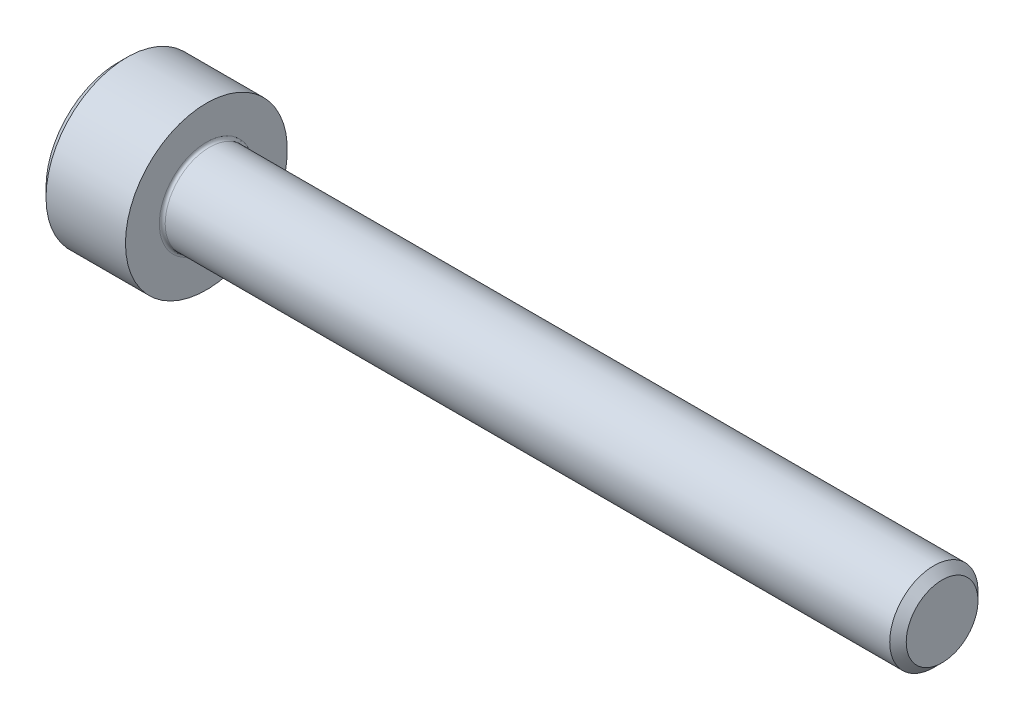
ISO-10303-21;
HEADER;
FILE_DESCRIPTION(('STEP AP214'),'2;1');
FILE_NAME('part.step','',(''),(''),'','','');
FILE_SCHEMA(('AUTOMOTIVE_DESIGN { 1 0 10303 214 1 1 1 1 }'));
ENDSEC;
DATA;
#1=APPLICATION_CONTEXT('core data for automotive mechanical design processes');
#2=APPLICATION_PROTOCOL_DEFINITION('international standard','automotive_design',2000,#1);
#3=PRODUCT_CONTEXT('',#1,'mechanical');
#4=PRODUCT('Part','Part','',(#3));
#5=PRODUCT_RELATED_PRODUCT_CATEGORY('part','',(#4));
#6=PRODUCT_DEFINITION_FORMATION('','',#4);
#7=PRODUCT_DEFINITION_CONTEXT('part definition',#1,'design');
#8=PRODUCT_DEFINITION('design','',#6,#7);
#9=PRODUCT_DEFINITION_SHAPE('','',#8);
#10=(LENGTH_UNIT() NAMED_UNIT(*) SI_UNIT(.MILLI.,.METRE.));
#11=(NAMED_UNIT(*) PLANE_ANGLE_UNIT() SI_UNIT($,.RADIAN.));
#12=(NAMED_UNIT(*) SI_UNIT($,.STERADIAN.) SOLID_ANGLE_UNIT());
#13=UNCERTAINTY_MEASURE_WITH_UNIT(LENGTH_MEASURE(1.E-05),#10,'distance_accuracy_value','');
#14=(GEOMETRIC_REPRESENTATION_CONTEXT(3) GLOBAL_UNCERTAINTY_ASSIGNED_CONTEXT((#13)) GLOBAL_UNIT_ASSIGNED_CONTEXT((#10,
#11,#12)) REPRESENTATION_CONTEXT('',''));
#15=CARTESIAN_POINT('',(0.,0.,0.));
#16=DIRECTION('',(0.,0.,1.));
#17=DIRECTION('',(1.,0.,0.));
#18=AXIS2_PLACEMENT_3D('',#15,#16,#17);
#19=CARTESIAN_POINT('',(0.,0.,0.));
#20=DIRECTION('',(-1.,0.,0.));
#21=DIRECTION('',(0.,0.,1.));
#22=AXIS2_PLACEMENT_3D('',#19,#20,#21);
#23=PLANE('',#22);
#24=DIRECTION('',(0.,-0.5,0.86602540378444));
#25=VECTOR('',#24,1.);
#26=CARTESIAN_POINT('',(0.,1.47801668912544,0.));
#27=LINE('',#26,#25);
#28=CARTESIAN_POINT('',(0.,1.47801668912544,0.));
#29=VERTEX_POINT('',#28);
#30=CARTESIAN_POINT('',(0.,0.73900834456272,1.28));
#31=VERTEX_POINT('',#30);
#32=EDGE_CURVE('E377',#29,#31,#27,.T.);
#33=ORIENTED_EDGE('',*,*,#32,.T.);
#34=DIRECTION('',(0.,1.,0.));
#35=VECTOR('',#34,1.);
#36=CARTESIAN_POINT('',(0.,-0.739008344562722,1.28));
#37=LINE('',#36,#35);
#38=CARTESIAN_POINT('',(0.,-0.739008344562722,1.28));
#39=VERTEX_POINT('',#38);
#40=EDGE_CURVE('E109',#39,#31,#37,.T.);
#41=ORIENTED_EDGE('',*,*,#40,.F.);
#42=DIRECTION('',(0.,-0.5,-0.866025403784438));
#43=VECTOR('',#42,1.);
#44=CARTESIAN_POINT('',(0.,-0.739008344562722,1.28));
#45=LINE('',#44,#43);
#46=CARTESIAN_POINT('',(0.,-1.47801668912544,0.));
#47=VERTEX_POINT('',#46);
#48=EDGE_CURVE('E380',#39,#47,#45,.T.);
#49=ORIENTED_EDGE('',*,*,#48,.T.);
#50=DIRECTION('',(0.,0.5,-0.86602540378444));
#51=VECTOR('',#50,1.);
#52=CARTESIAN_POINT('',(0.,-1.47801668912544,0.));
#53=LINE('',#52,#51);
#54=CARTESIAN_POINT('',(0.,-0.739008344562726,-1.28));
#55=VERTEX_POINT('',#54);
#56=EDGE_CURVE('E383',#47,#55,#53,.T.);
#57=ORIENTED_EDGE('',*,*,#56,.T.);
#58=DIRECTION('',(0.,-1.,0.));
#59=VECTOR('',#58,1.);
#60=CARTESIAN_POINT('',(0.,0.739008344562716,-1.28));
#61=LINE('',#60,#59);
#62=CARTESIAN_POINT('',(0.,0.739008344562716,-1.28));
#63=VERTEX_POINT('',#62);
#64=EDGE_CURVE('E386',#63,#55,#61,.T.);
#65=ORIENTED_EDGE('',*,*,#64,.F.);
#66=DIRECTION('',(0.,-0.5,-0.866025403784438));
#67=VECTOR('',#66,1.);
#68=CARTESIAN_POINT('',(0.,1.47801668912544,0.));
#69=LINE('',#68,#67);
#70=EDGE_CURVE('E104',#29,#63,#69,.T.);
#71=ORIENTED_EDGE('',*,*,#70,.F.);
#72=EDGE_LOOP('',(#33,#41,#49,#57,#65,#71));
#73=FACE_BOUND('',#72,.T.);
#74=CARTESIAN_POINT('',(0.,0.,0.));
#75=DIRECTION('',(-1.,0.,0.));
#76=DIRECTION('',(0.,0.,1.));
#77=AXIS2_PLACEMENT_3D('',#74,#75,#76);
#78=CIRCLE('',#77,2.45);
#79=CARTESIAN_POINT('',(0.,0.,2.45));
#80=VERTEX_POINT('',#79);
#81=EDGE_CURVE('E120',#80,#80,#78,.T.);
#82=ORIENTED_EDGE('',*,*,#81,.T.);
#83=EDGE_LOOP('',(#82));
#84=FACE_BOUND('',#83,.T.);
#85=ADVANCED_FACE('F17',(#73,#84),#23,.T.);
#86=CARTESIAN_POINT('',(28.,1.2195,0.));
#87=DIRECTION('',(1.,0.,0.));
#88=DIRECTION('',(0.,0.,-1.));
#89=AXIS2_PLACEMENT_3D('',#86,#87,#88);
#90=PLANE('',#89);
#91=CARTESIAN_POINT('',(28.,0.,0.));
#92=DIRECTION('',(-1.,0.,0.));
#93=DIRECTION('',(0.,0.,1.));
#94=AXIS2_PLACEMENT_3D('',#91,#92,#93);
#95=CIRCLE('',#94,1.2195);
#96=CARTESIAN_POINT('',(28.,0.,1.2195));
#97=VERTEX_POINT('',#96);
#98=EDGE_CURVE('E133',#97,#97,#95,.T.);
#99=ORIENTED_EDGE('',*,*,#98,.F.);
#100=EDGE_LOOP('',(#99));
#101=FACE_BOUND('',#100,.T.);
#102=ADVANCED_FACE('F155',(#101),#90,.T.);
#103=CARTESIAN_POINT('',(28.,0.,0.));
#104=DIRECTION('',(-1.,0.,0.));
#105=DIRECTION('',(0.,0.,1.));
#106=AXIS2_PLACEMENT_3D('',#103,#104,#105);
#107=CONICAL_SURFACE('',#106,1.2195,0.785398163397069);
#108=CARTESIAN_POINT('',(27.7195,0.,0.));
#109=DIRECTION('',(-1.,0.,0.));
#110=DIRECTION('',(0.,0.,1.));
#111=AXIS2_PLACEMENT_3D('',#108,#109,#110);
#112=CIRCLE('',#111,1.49999999999989);
#113=CARTESIAN_POINT('',(27.7195,0.,1.49999999999989));
#114=VERTEX_POINT('',#113);
#115=EDGE_CURVE('E130',#114,#114,#112,.T.);
#116=ORIENTED_EDGE('',*,*,#115,.F.);
#117=EDGE_LOOP('',(#116));
#118=FACE_BOUND('',#117,.T.);
#119=ORIENTED_EDGE('',*,*,#98,.T.);
#120=EDGE_LOOP('',(#119));
#121=FACE_BOUND('',#120,.T.);
#122=ADVANCED_FACE('F161',(#118,#121),#107,.T.);
#123=CARTESIAN_POINT('',(-31.75,0.,0.));
#124=DIRECTION('',(-1.,0.,0.));
#125=DIRECTION('',(0.,0.,1.));
#126=AXIS2_PLACEMENT_3D('',#123,#124,#125);
#127=CYLINDRICAL_SURFACE('',#126,1.49999999999994);
#128=CARTESIAN_POINT('',(3.1,0.,0.));
#129=DIRECTION('',(1.,0.,0.));
#130=DIRECTION('',(0.,0.,-1.));
#131=AXIS2_PLACEMENT_3D('',#128,#129,#130);
#132=CIRCLE('',#131,1.49999999999994);
#133=CARTESIAN_POINT('',(3.1,0.,-1.49999999999994));
#134=VERTEX_POINT('',#133);
#135=EDGE_CURVE('E11',#134,#134,#132,.T.);
#136=ORIENTED_EDGE('',*,*,#135,.T.);
#137=EDGE_LOOP('',(#136));
#138=FACE_BOUND('',#137,.T.);
#139=ORIENTED_EDGE('',*,*,#115,.T.);
#140=EDGE_LOOP('',(#139));
#141=FACE_BOUND('',#140,.T.);
#142=ADVANCED_FACE('F172',(#138,#141),#127,.T.);
#143=CARTESIAN_POINT('',(3.,2.75,0.));
#144=DIRECTION('',(1.,0.,0.));
#145=DIRECTION('',(0.,0.,-1.));
#146=AXIS2_PLACEMENT_3D('',#143,#144,#145);
#147=PLANE('',#146);
#148=CARTESIAN_POINT('',(3.,0.,0.));
#149=DIRECTION('',(1.,0.,0.));
#150=DIRECTION('',(0.,0.,-1.));
#151=AXIS2_PLACEMENT_3D('',#148,#149,#150);
#152=CIRCLE('',#151,1.59999999999995);
#153=CARTESIAN_POINT('',(3.,0.,-1.59999999999995));
#154=VERTEX_POINT('',#153);
#155=EDGE_CURVE('E25',#154,#154,#152,.F.);
#156=ORIENTED_EDGE('',*,*,#155,.T.);
#157=EDGE_LOOP('',(#156));
#158=FACE_BOUND('',#157,.T.);
#159=CARTESIAN_POINT('',(3.,0.,0.));
#160=DIRECTION('',(-1.,0.,0.));
#161=DIRECTION('',(0.,0.,1.));
#162=AXIS2_PLACEMENT_3D('',#159,#160,#161);
#163=CIRCLE('',#162,2.75);
#164=CARTESIAN_POINT('',(3.,0.,2.75));
#165=VERTEX_POINT('',#164);
#166=EDGE_CURVE('E127',#165,#165,#163,.T.);
#167=ORIENTED_EDGE('',*,*,#166,.F.);
#168=EDGE_LOOP('',(#167));
#169=FACE_BOUND('',#168,.T.);
#170=ADVANCED_FACE('F138',(#158,#169),#147,.T.);
#171=CARTESIAN_POINT('',(-31.75,0.,0.));
#172=DIRECTION('',(-1.,0.,0.));
#173=DIRECTION('',(0.,0.,1.));
#174=AXIS2_PLACEMENT_3D('',#171,#172,#173);
#175=CYLINDRICAL_SURFACE('',#174,2.75);
#176=ORIENTED_EDGE('',*,*,#166,.T.);
#177=EDGE_LOOP('',(#176));
#178=FACE_BOUND('',#177,.T.);
#179=CARTESIAN_POINT('',(0.3,0.,0.));
#180=DIRECTION('',(-1.,0.,0.));
#181=DIRECTION('',(0.,0.,1.));
#182=AXIS2_PLACEMENT_3D('',#179,#180,#181);
#183=CIRCLE('',#182,2.75);
#184=CARTESIAN_POINT('',(0.3,0.,2.75));
#185=VERTEX_POINT('',#184);
#186=EDGE_CURVE('E124',#185,#185,#183,.T.);
#187=ORIENTED_EDGE('',*,*,#186,.F.);
#188=EDGE_LOOP('',(#187));
#189=FACE_BOUND('',#188,.T.);
#190=ADVANCED_FACE('F150',(#178,#189),#175,.T.);
#191=CARTESIAN_POINT('',(0.,0.,0.));
#192=DIRECTION('',(1.,0.,0.));
#193=DIRECTION('',(0.,0.,-1.));
#194=AXIS2_PLACEMENT_3D('',#191,#192,#193);
#195=CONICAL_SURFACE('',#194,2.45,0.785398163397439);
#196=ORIENTED_EDGE('',*,*,#186,.T.);
#197=EDGE_LOOP('',(#196));
#198=FACE_BOUND('',#197,.T.);
#199=ORIENTED_EDGE('',*,*,#81,.F.);
#200=EDGE_LOOP('',(#199));
#201=FACE_BOUND('',#200,.T.);
#202=ADVANCED_FACE('F142',(#198,#201),#195,.T.);
#203=CARTESIAN_POINT('',(3.1,0.,0.));
#204=DIRECTION('',(1.,0.,0.));
#205=DIRECTION('',(0.,0.,-1.));
#206=AXIS2_PLACEMENT_3D('',#203,#204,#205);
#207=TOROIDAL_SURFACE('',#206,1.59999999999995,0.1);
#208=ORIENTED_EDGE('',*,*,#135,.F.);
#209=EDGE_LOOP('',(#208));
#210=FACE_BOUND('',#209,.T.);
#211=ORIENTED_EDGE('',*,*,#155,.F.);
#212=EDGE_LOOP('',(#211));
#213=FACE_BOUND('',#212,.T.);
#214=ADVANCED_FACE('F19',(#210,#213),#207,.F.);
#215=CARTESIAN_POINT('',(1.3,1.47801668912544,0.));
#216=DIRECTION('',(0.,-0.86602540378444,-0.5));
#217=DIRECTION('',(0.,0.5,-0.86602540378444));
#218=AXIS2_PLACEMENT_3D('',#215,#216,#217);
#219=PLANE('',#218);
#220=ORIENTED_EDGE('',*,*,#32,.F.);
#221=DIRECTION('',(-1.,0.,0.));
#222=VECTOR('',#221,1.);
#223=CARTESIAN_POINT('',(1.3,1.47801668912544,0.));
#224=LINE('',#223,#222);
#225=CARTESIAN_POINT('',(1.3,1.47801668912544,0.));
#226=VERTEX_POINT('',#225);
#227=EDGE_CURVE('E376',#226,#29,#224,.T.);
#228=ORIENTED_EDGE('',*,*,#227,.F.);
#229=DIRECTION('',(0.,-0.5,0.86602540378444));
#230=VECTOR('',#229,1.);
#231=CARTESIAN_POINT('',(1.3,1.47801668912544,0.));
#232=LINE('',#231,#230);
#233=CARTESIAN_POINT('',(1.3,1.10851251684408,0.64));
#234=VERTEX_POINT('',#233);
#235=EDGE_CURVE('E32',#226,#234,#232,.T.);
#236=ORIENTED_EDGE('',*,*,#235,.T.);
#237=CARTESIAN_POINT('',(1.3,0.73900834456272,1.28));
#238=VERTEX_POINT('',#237);
#239=EDGE_CURVE('E90',#234,#238,#232,.T.);
#240=ORIENTED_EDGE('',*,*,#239,.T.);
#241=DIRECTION('',(-1.,0.,0.));
#242=VECTOR('',#241,1.);
#243=CARTESIAN_POINT('',(1.3,0.73900834456272,1.28));
#244=LINE('',#243,#242);
#245=EDGE_CURVE('E102',#238,#31,#244,.T.);
#246=ORIENTED_EDGE('',*,*,#245,.T.);
#247=EDGE_LOOP('',(#220,#228,#236,#240,#246));
#248=FACE_BOUND('',#247,.T.);
#249=ADVANCED_FACE('F101',(#248),#219,.T.);
#250=CARTESIAN_POINT('',(1.3,-0.739008344562722,1.28));
#251=DIRECTION('',(0.,0.,1.));
#252=DIRECTION('',(0.,-1.,0.));
#253=AXIS2_PLACEMENT_3D('',#250,#251,#252);
#254=PLANE('',#253);
#255=ORIENTED_EDGE('',*,*,#40,.T.);
#256=ORIENTED_EDGE('',*,*,#245,.F.);
#257=DIRECTION('',(0.,1.,0.));
#258=VECTOR('',#257,1.);
#259=CARTESIAN_POINT('',(1.3,-0.739008344562722,1.28));
#260=LINE('',#259,#258);
#261=CARTESIAN_POINT('',(1.3,0.,1.28));
#262=VERTEX_POINT('',#261);
#263=EDGE_CURVE('E88',#262,#238,#260,.T.);
#264=ORIENTED_EDGE('',*,*,#263,.F.);
#265=CARTESIAN_POINT('',(1.3,-0.739008344562722,1.28));
#266=VERTEX_POINT('',#265);
#267=EDGE_CURVE('E98',#266,#262,#260,.T.);
#268=ORIENTED_EDGE('',*,*,#267,.F.);
#269=DIRECTION('',(-1.,0.,0.));
#270=VECTOR('',#269,1.);
#271=CARTESIAN_POINT('',(1.3,-0.739008344562722,1.28));
#272=LINE('',#271,#270);
#273=EDGE_CURVE('E111',#266,#39,#272,.T.);
#274=ORIENTED_EDGE('',*,*,#273,.T.);
#275=EDGE_LOOP('',(#255,#256,#264,#268,#274));
#276=FACE_BOUND('',#275,.T.);
#277=ADVANCED_FACE('F106',(#276),#254,.F.);
#278=CARTESIAN_POINT('',(1.3,-0.739008344562722,1.28));
#279=DIRECTION('',(0.,0.866025403784438,-0.5));
#280=DIRECTION('',(0.,0.5,0.866025403784438));
#281=AXIS2_PLACEMENT_3D('',#278,#279,#280);
#282=PLANE('',#281);
#283=ORIENTED_EDGE('',*,*,#48,.F.);
#284=ORIENTED_EDGE('',*,*,#273,.F.);
#285=DIRECTION('',(0.,-0.5,-0.866025403784438));
#286=VECTOR('',#285,1.);
#287=CARTESIAN_POINT('',(1.3,-0.739008344562722,1.28));
#288=LINE('',#287,#286);
#289=CARTESIAN_POINT('',(1.3,-1.10851251684408,0.64));
#290=VERTEX_POINT('',#289);
#291=EDGE_CURVE('E355',#266,#290,#288,.T.);
#292=ORIENTED_EDGE('',*,*,#291,.T.);
#293=CARTESIAN_POINT('',(1.3,-1.47801668912544,0.));
#294=VERTEX_POINT('',#293);
#295=EDGE_CURVE('E357',#290,#294,#288,.T.);
#296=ORIENTED_EDGE('',*,*,#295,.T.);
#297=DIRECTION('',(-1.,0.,0.));
#298=VECTOR('',#297,1.);
#299=CARTESIAN_POINT('',(1.3,-1.47801668912544,0.));
#300=LINE('',#299,#298);
#301=EDGE_CURVE('E116',#294,#47,#300,.T.);
#302=ORIENTED_EDGE('',*,*,#301,.T.);
#303=EDGE_LOOP('',(#283,#284,#292,#296,#302));
#304=FACE_BOUND('',#303,.T.);
#305=ADVANCED_FACE('F232',(#304),#282,.T.);
#306=CARTESIAN_POINT('',(1.3,-1.47801668912544,0.));
#307=DIRECTION('',(0.,0.86602540378444,0.5));
#308=DIRECTION('',(0.,-0.5,0.86602540378444));
#309=AXIS2_PLACEMENT_3D('',#306,#307,#308);
#310=PLANE('',#309);
#311=ORIENTED_EDGE('',*,*,#56,.F.);
#312=ORIENTED_EDGE('',*,*,#301,.F.);
#313=DIRECTION('',(0.,0.5,-0.86602540378444));
#314=VECTOR('',#313,1.);
#315=CARTESIAN_POINT('',(1.3,-1.47801668912544,0.));
#316=LINE('',#315,#314);
#317=CARTESIAN_POINT('',(1.3,-1.10851251684409,-0.64));
#318=VERTEX_POINT('',#317);
#319=EDGE_CURVE('E360',#294,#318,#316,.T.);
#320=ORIENTED_EDGE('',*,*,#319,.T.);
#321=CARTESIAN_POINT('',(1.3,-0.739008344562726,-1.28));
#322=VERTEX_POINT('',#321);
#323=EDGE_CURVE('E364',#318,#322,#316,.T.);
#324=ORIENTED_EDGE('',*,*,#323,.T.);
#325=DIRECTION('',(-1.,0.,0.));
#326=VECTOR('',#325,1.);
#327=CARTESIAN_POINT('',(1.3,-0.739008344562726,-1.28));
#328=LINE('',#327,#326);
#329=EDGE_CURVE('E395',#322,#55,#328,.T.);
#330=ORIENTED_EDGE('',*,*,#329,.T.);
#331=EDGE_LOOP('',(#311,#312,#320,#324,#330));
#332=FACE_BOUND('',#331,.T.);
#333=ADVANCED_FACE('F242',(#332),#310,.T.);
#334=CARTESIAN_POINT('',(1.3,0.739008344562716,-1.28));
#335=DIRECTION('',(0.,0.,-1.));
#336=DIRECTION('',(0.,1.,0.));
#337=AXIS2_PLACEMENT_3D('',#334,#335,#336);
#338=PLANE('',#337);
#339=ORIENTED_EDGE('',*,*,#64,.T.);
#340=ORIENTED_EDGE('',*,*,#329,.F.);
#341=DIRECTION('',(0.,-1.,0.));
#342=VECTOR('',#341,1.);
#343=CARTESIAN_POINT('',(1.3,0.739008344562716,-1.28));
#344=LINE('',#343,#342);
#345=CARTESIAN_POINT('',(1.3,0.,-1.28));
#346=VERTEX_POINT('',#345);
#347=EDGE_CURVE('E368',#346,#322,#344,.T.);
#348=ORIENTED_EDGE('',*,*,#347,.F.);
#349=CARTESIAN_POINT('',(1.3,0.739008344562716,-1.28));
#350=VERTEX_POINT('',#349);
#351=EDGE_CURVE('E369',#350,#346,#344,.T.);
#352=ORIENTED_EDGE('',*,*,#351,.F.);
#353=DIRECTION('',(-1.,0.,0.));
#354=VECTOR('',#353,1.);
#355=CARTESIAN_POINT('',(1.3,0.739008344562716,-1.28));
#356=LINE('',#355,#354);
#357=EDGE_CURVE('E392',#350,#63,#356,.T.);
#358=ORIENTED_EDGE('',*,*,#357,.T.);
#359=EDGE_LOOP('',(#339,#340,#348,#352,#358));
#360=FACE_BOUND('',#359,.T.);
#361=ADVANCED_FACE('F252',(#360),#338,.F.);
#362=CARTESIAN_POINT('',(1.3,1.47801668912544,0.));
#363=DIRECTION('',(0.,0.866025403784438,-0.5));
#364=DIRECTION('',(0.,0.5,0.866025403784438));
#365=AXIS2_PLACEMENT_3D('',#362,#363,#364);
#366=PLANE('',#365);
#367=ORIENTED_EDGE('',*,*,#70,.T.);
#368=ORIENTED_EDGE('',*,*,#357,.F.);
#369=DIRECTION('',(0.,-0.5,-0.866025403784438));
#370=VECTOR('',#369,1.);
#371=CARTESIAN_POINT('',(1.3,1.47801668912544,0.));
#372=LINE('',#371,#370);
#373=CARTESIAN_POINT('',(1.3,1.10851251684408,-0.64));
#374=VERTEX_POINT('',#373);
#375=EDGE_CURVE('E372',#374,#350,#372,.T.);
#376=ORIENTED_EDGE('',*,*,#375,.F.);
#377=EDGE_CURVE('E373',#226,#374,#372,.T.);
#378=ORIENTED_EDGE('',*,*,#377,.F.);
#379=ORIENTED_EDGE('',*,*,#227,.T.);
#380=EDGE_LOOP('',(#367,#368,#376,#378,#379));
#381=FACE_BOUND('',#380,.T.);
#382=ADVANCED_FACE('F262',(#381),#366,.F.);
#383=CARTESIAN_POINT('',(1.3,0.73900834456272,1.28));
#384=DIRECTION('',(-1.,0.,0.));
#385=DIRECTION('',(0.,0.,1.));
#386=AXIS2_PLACEMENT_3D('',#383,#384,#385);
#387=PLANE('',#386);
#388=CARTESIAN_POINT('',(1.3,0.,0.));
#389=DIRECTION('',(-1.,0.,0.));
#390=DIRECTION('',(0.,0.,1.));
#391=AXIS2_PLACEMENT_3D('',#388,#389,#390);
#392=CIRCLE('',#391,1.28);
#393=EDGE_CURVE('E110',#290,#262,#392,.T.);
#394=ORIENTED_EDGE('',*,*,#393,.F.);
#395=ORIENTED_EDGE('',*,*,#291,.F.);
#396=ORIENTED_EDGE('',*,*,#267,.T.);
#397=EDGE_LOOP('',(#394,#395,#396));
#398=FACE_BOUND('',#397,.T.);
#399=ADVANCED_FACE('F272',(#398),#387,.T.);
#400=EDGE_CURVE('E114',#318,#290,#392,.T.);
#401=ORIENTED_EDGE('',*,*,#400,.F.);
#402=ORIENTED_EDGE('',*,*,#319,.F.);
#403=ORIENTED_EDGE('',*,*,#295,.F.);
#404=EDGE_LOOP('',(#401,#402,#403));
#405=FACE_BOUND('',#404,.T.);
#406=ADVANCED_FACE('F282',(#405),#387,.T.);
#407=EDGE_CURVE('E403',#346,#318,#392,.T.);
#408=ORIENTED_EDGE('',*,*,#407,.F.);
#409=ORIENTED_EDGE('',*,*,#347,.T.);
#410=ORIENTED_EDGE('',*,*,#323,.F.);
#411=EDGE_LOOP('',(#408,#409,#410));
#412=FACE_BOUND('',#411,.T.);
#413=ADVANCED_FACE('F292',(#412),#387,.T.);
#414=EDGE_CURVE('E402',#374,#346,#392,.T.);
#415=ORIENTED_EDGE('',*,*,#414,.F.);
#416=ORIENTED_EDGE('',*,*,#375,.T.);
#417=ORIENTED_EDGE('',*,*,#351,.T.);
#418=EDGE_LOOP('',(#415,#416,#417));
#419=FACE_BOUND('',#418,.T.);
#420=ADVANCED_FACE('F301',(#419),#387,.T.);
#421=EDGE_CURVE('E121',#234,#374,#392,.T.);
#422=ORIENTED_EDGE('',*,*,#421,.F.);
#423=ORIENTED_EDGE('',*,*,#235,.F.);
#424=ORIENTED_EDGE('',*,*,#377,.T.);
#425=EDGE_LOOP('',(#422,#423,#424));
#426=FACE_BOUND('',#425,.T.);
#427=ADVANCED_FACE('F310',(#426),#387,.T.);
#428=EDGE_CURVE('E93',#262,#234,#392,.T.);
#429=ORIENTED_EDGE('',*,*,#428,.F.);
#430=ORIENTED_EDGE('',*,*,#263,.T.);
#431=ORIENTED_EDGE('',*,*,#239,.F.);
#432=EDGE_LOOP('',(#429,#430,#431));
#433=FACE_BOUND('',#432,.T.);
#434=ADVANCED_FACE('F89',(#433),#387,.T.);
#435=CARTESIAN_POINT('',(1.3,0.,0.));
#436=DIRECTION('',(-1.,0.,0.));
#437=DIRECTION('',(0.,0.,1.));
#438=AXIS2_PLACEMENT_3D('',#435,#436,#437);
#439=CONICAL_SURFACE('',#438,1.28,1.0471975511966);
#440=CARTESIAN_POINT('',(2.03900834456273,0.,0.));
#441=VERTEX_POINT('',#440);
#442=VERTEX_LOOP('',#441);
#443=FACE_BOUND('',#442,.T.);
#444=ORIENTED_EDGE('',*,*,#428,.T.);
#445=ORIENTED_EDGE('',*,*,#421,.T.);
#446=ORIENTED_EDGE('',*,*,#414,.T.);
#447=ORIENTED_EDGE('',*,*,#407,.T.);
#448=ORIENTED_EDGE('',*,*,#400,.T.);
#449=ORIENTED_EDGE('',*,*,#393,.T.);
#450=EDGE_LOOP('',(#444,#445,#446,#447,#448,#449));
#451=FACE_BOUND('',#450,.T.);
#452=ADVANCED_FACE('F165',(#443,#451),#439,.F.);
#453=CLOSED_SHELL('',(#85,#102,#122,#142,#170,#190,#202,#214,#249,#277,#305,#333,#361,#382,#399,
#406,#413,#420,#427,#434,#452));
#454=MANIFOLD_SOLID_BREP('B1',#453);
#455=ADVANCED_BREP_SHAPE_REPRESENTATION('',(#18,#454),#14);
#456=SHAPE_DEFINITION_REPRESENTATION(#9,#455);
ENDSEC;
END-ISO-10303-21;
